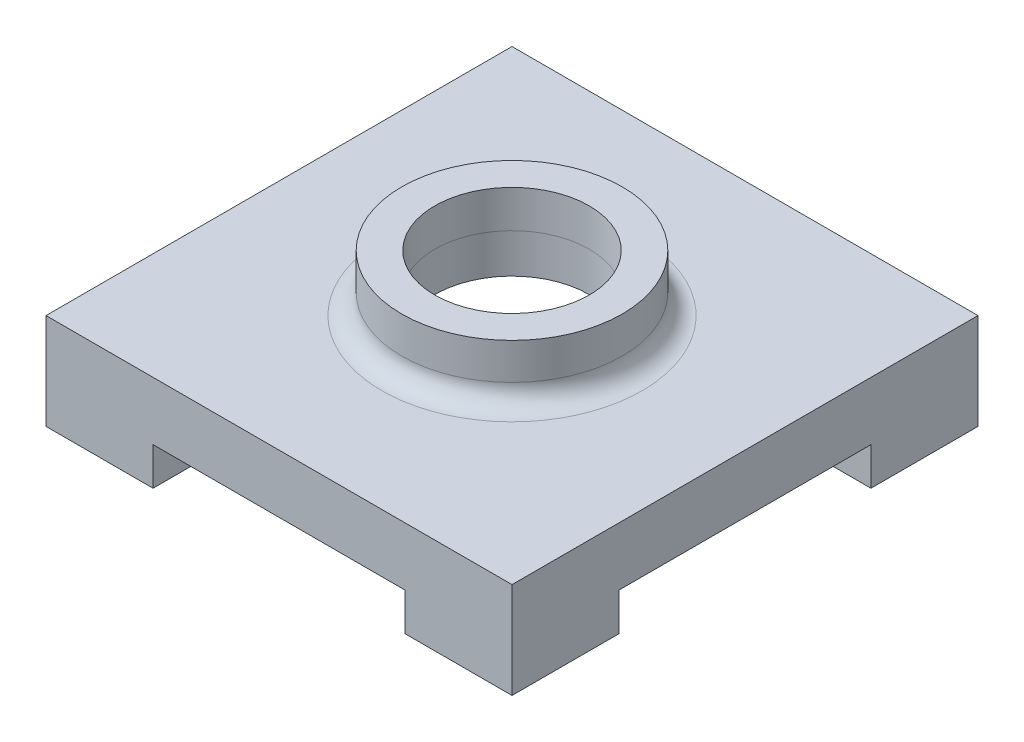
ISO-10303-21;
HEADER;
FILE_DESCRIPTION(('STEP AP214'),'2;1');
FILE_NAME('part.step','',(''),(''),'','','');
FILE_SCHEMA(('AUTOMOTIVE_DESIGN { 1 0 10303 214 1 1 1 1 }'));
ENDSEC;
DATA;
#1=APPLICATION_CONTEXT('core data for automotive mechanical design processes');
#2=APPLICATION_PROTOCOL_DEFINITION('international standard','automotive_design',2000,#1);
#3=PRODUCT_CONTEXT('',#1,'mechanical');
#4=PRODUCT('Part','Part','',(#3));
#5=PRODUCT_RELATED_PRODUCT_CATEGORY('part','',(#4));
#6=PRODUCT_DEFINITION_FORMATION('','',#4);
#7=PRODUCT_DEFINITION_CONTEXT('part definition',#1,'design');
#8=PRODUCT_DEFINITION('design','',#6,#7);
#9=PRODUCT_DEFINITION_SHAPE('','',#8);
#10=(LENGTH_UNIT() NAMED_UNIT(*) SI_UNIT(.MILLI.,.METRE.));
#11=(NAMED_UNIT(*) PLANE_ANGLE_UNIT() SI_UNIT($,.RADIAN.));
#12=(NAMED_UNIT(*) SI_UNIT($,.STERADIAN.) SOLID_ANGLE_UNIT());
#13=UNCERTAINTY_MEASURE_WITH_UNIT(LENGTH_MEASURE(1.E-05),#10,'distance_accuracy_value','');
#14=(GEOMETRIC_REPRESENTATION_CONTEXT(3) GLOBAL_UNCERTAINTY_ASSIGNED_CONTEXT((#13)) GLOBAL_UNIT_ASSIGNED_CONTEXT((#10,
#11,#12)) REPRESENTATION_CONTEXT('',''));
#15=CARTESIAN_POINT('',(0.,0.,0.));
#16=DIRECTION('',(0.,0.,1.));
#17=DIRECTION('',(1.,0.,0.));
#18=AXIS2_PLACEMENT_3D('',#15,#16,#17);
#19=CARTESIAN_POINT('',(0.,18.25,0.));
#20=DIRECTION('',(0.,1.,0.));
#21=DIRECTION('',(0.,0.,1.));
#22=AXIS2_PLACEMENT_3D('',#19,#20,#21);
#23=CYLINDRICAL_SURFACE('',#22,12.2682);
#24=CARTESIAN_POINT('',(0.,18.25,0.));
#25=DIRECTION('',(0.,1.,0.));
#26=DIRECTION('',(0.,0.,1.));
#27=AXIS2_PLACEMENT_3D('',#24,#25,#26);
#28=CIRCLE('',#27,12.2682);
#29=CARTESIAN_POINT('',(0.,18.25,12.2682));
#30=VERTEX_POINT('',#29);
#31=EDGE_CURVE('E479',#30,#30,#28,.F.);
#32=ORIENTED_EDGE('',*,*,#31,.F.);
#33=EDGE_LOOP('',(#32));
#34=FACE_BOUND('',#33,.T.);
#35=CARTESIAN_POINT('',(0.,12.,0.));
#36=DIRECTION('',(0.,-1.,0.));
#37=DIRECTION('',(0.,0.,-1.));
#38=AXIS2_PLACEMENT_3D('',#35,#36,#37);
#39=CIRCLE('',#38,12.2682);
#40=CARTESIAN_POINT('',(0.,12.,-12.2682));
#41=VERTEX_POINT('',#40);
#42=EDGE_CURVE('E52',#41,#41,#39,.F.);
#43=ORIENTED_EDGE('',*,*,#42,.F.);
#44=EDGE_LOOP('',(#43));
#45=FACE_BOUND('',#44,.T.);
#46=ADVANCED_FACE('F48',(#34,#45),#23,.F.);
#47=CARTESIAN_POINT('',(0.,6.,0.));
#48=DIRECTION('',(0.,1.,0.));
#49=DIRECTION('',(0.,0.,1.));
#50=AXIS2_PLACEMENT_3D('',#47,#48,#49);
#51=PLANE('',#50);
#52=DIRECTION('',(0.,0.,1.));
#53=VECTOR('',#52,1.);
#54=CARTESIAN_POINT('',(-37.,6.,0.));
#55=LINE('',#54,#53);
#56=CARTESIAN_POINT('',(-37.,6.,-20.));
#57=VERTEX_POINT('',#56);
#58=CARTESIAN_POINT('',(-37.,6.,20.));
#59=VERTEX_POINT('',#58);
#60=EDGE_CURVE('E333',#57,#59,#55,.T.);
#61=ORIENTED_EDGE('',*,*,#60,.F.);
#62=DIRECTION('',(1.,0.,0.));
#63=VECTOR('',#62,1.);
#64=CARTESIAN_POINT('',(-40.,6.,-20.));
#65=LINE('',#64,#63);
#66=CARTESIAN_POINT('',(-25.,6.,-20.));
#67=VERTEX_POINT('',#66);
#68=EDGE_CURVE('E452',#57,#67,#65,.T.);
#69=ORIENTED_EDGE('',*,*,#68,.T.);
#70=DIRECTION('',(0.,0.,1.));
#71=VECTOR('',#70,1.);
#72=CARTESIAN_POINT('',(-25.,6.,0.));
#73=LINE('',#72,#71);
#74=CARTESIAN_POINT('',(-25.,6.,20.));
#75=VERTEX_POINT('',#74);
#76=EDGE_CURVE('E419',#67,#75,#73,.T.);
#77=ORIENTED_EDGE('',*,*,#76,.T.);
#78=DIRECTION('',(-1.,0.,0.));
#79=VECTOR('',#78,1.);
#80=CARTESIAN_POINT('',(40.,6.,20.));
#81=LINE('',#80,#79);
#82=EDGE_CURVE('E455',#75,#59,#81,.T.);
#83=ORIENTED_EDGE('',*,*,#82,.T.);
#84=EDGE_LOOP('',(#61,#69,#77,#83));
#85=FACE_BOUND('',#84,.T.);
#86=ADVANCED_FACE('F565',(#85),#51,.F.);
#87=DIRECTION('',(1.,0.,0.));
#88=VECTOR('',#87,1.);
#89=CARTESIAN_POINT('',(0.,6.,37.));
#90=LINE('',#89,#88);
#91=CARTESIAN_POINT('',(-20.,6.,37.));
#92=VERTEX_POINT('',#91);
#93=CARTESIAN_POINT('',(20.,6.,37.));
#94=VERTEX_POINT('',#93);
#95=EDGE_CURVE('E356',#92,#94,#90,.T.);
#96=ORIENTED_EDGE('',*,*,#95,.F.);
#97=DIRECTION('',(0.,0.,-1.));
#98=VECTOR('',#97,1.);
#99=CARTESIAN_POINT('',(-20.,6.,-40.));
#100=LINE('',#99,#98);
#101=CARTESIAN_POINT('',(-20.,6.,25.));
#102=VERTEX_POINT('',#101);
#103=EDGE_CURVE('E484',#92,#102,#100,.T.);
#104=ORIENTED_EDGE('',*,*,#103,.T.);
#105=DIRECTION('',(1.,0.,0.));
#106=VECTOR('',#105,1.);
#107=CARTESIAN_POINT('',(0.,6.,25.));
#108=LINE('',#107,#106);
#109=CARTESIAN_POINT('',(20.,6.,25.));
#110=VERTEX_POINT('',#109);
#111=EDGE_CURVE('E511',#102,#110,#108,.T.);
#112=ORIENTED_EDGE('',*,*,#111,.T.);
#113=DIRECTION('',(0.,0.,1.));
#114=VECTOR('',#113,1.);
#115=CARTESIAN_POINT('',(20.,6.,40.));
#116=LINE('',#115,#114);
#117=EDGE_CURVE('E487',#110,#94,#116,.T.);
#118=ORIENTED_EDGE('',*,*,#117,.T.);
#119=EDGE_LOOP('',(#96,#104,#112,#118));
#120=FACE_BOUND('',#119,.T.);
#121=ADVANCED_FACE('F594',(#120),#51,.F.);
#122=DIRECTION('',(0.,0.,-1.));
#123=VECTOR('',#122,1.);
#124=CARTESIAN_POINT('',(37.,6.,0.));
#125=LINE('',#124,#123);
#126=CARTESIAN_POINT('',(37.,6.,20.));
#127=VERTEX_POINT('',#126);
#128=CARTESIAN_POINT('',(37.,6.,-20.));
#129=VERTEX_POINT('',#128);
#130=EDGE_CURVE('E347',#127,#129,#125,.T.);
#131=ORIENTED_EDGE('',*,*,#130,.F.);
#132=CARTESIAN_POINT('',(25.,6.,20.));
#133=VERTEX_POINT('',#132);
#134=EDGE_CURVE('E457',#127,#133,#81,.T.);
#135=ORIENTED_EDGE('',*,*,#134,.T.);
#136=DIRECTION('',(0.,0.,-1.));
#137=VECTOR('',#136,1.);
#138=CARTESIAN_POINT('',(25.,6.,0.));
#139=LINE('',#138,#137);
#140=CARTESIAN_POINT('',(25.,6.,-20.));
#141=VERTEX_POINT('',#140);
#142=EDGE_CURVE('E427',#133,#141,#139,.T.);
#143=ORIENTED_EDGE('',*,*,#142,.T.);
#144=EDGE_CURVE('E456',#141,#129,#65,.T.);
#145=ORIENTED_EDGE('',*,*,#144,.T.);
#146=EDGE_LOOP('',(#131,#135,#143,#145));
#147=FACE_BOUND('',#146,.T.);
#148=ADVANCED_FACE('F616',(#147),#51,.F.);
#149=CARTESIAN_POINT('',(-40.,0.,0.));
#150=DIRECTION('',(0.,-1.,0.));
#151=DIRECTION('',(0.,0.,-1.));
#152=AXIS2_PLACEMENT_3D('',#149,#150,#151);
#153=PLANE('',#152);
#154=CARTESIAN_POINT('',(-27.5,0.,27.5));
#155=DIRECTION('',(0.,-1.,0.));
#156=DIRECTION('',(0.,0.,-1.));
#157=AXIS2_PLACEMENT_3D('',#154,#155,#156);
#158=CIRCLE('',#157,1.65);
#159=CARTESIAN_POINT('',(-27.5,0.,25.85));
#160=VERTEX_POINT('',#159);
#161=EDGE_CURVE('E395',#160,#160,#158,.T.);
#162=ORIENTED_EDGE('',*,*,#161,.F.);
#163=EDGE_LOOP('',(#162));
#164=FACE_BOUND('',#163,.T.);
#165=DIRECTION('',(1.,0.,0.));
#166=VECTOR('',#165,1.);
#167=CARTESIAN_POINT('',(-37.,0.,37.));
#168=LINE('',#167,#166);
#169=CARTESIAN_POINT('',(-37.,0.,37.));
#170=VERTEX_POINT('',#169);
#171=CARTESIAN_POINT('',(-20.,0.,37.));
#172=VERTEX_POINT('',#171);
#173=EDGE_CURVE('E304',#170,#172,#168,.T.);
#174=ORIENTED_EDGE('',*,*,#173,.F.);
#175=DIRECTION('',(0.,0.,1.));
#176=VECTOR('',#175,1.);
#177=CARTESIAN_POINT('',(-37.,0.,-37.));
#178=LINE('',#177,#176);
#179=CARTESIAN_POINT('',(-37.,0.,20.));
#180=VERTEX_POINT('',#179);
#181=EDGE_CURVE('E303',#180,#170,#178,.T.);
#182=ORIENTED_EDGE('',*,*,#181,.F.);
#183=DIRECTION('',(-1.,0.,0.));
#184=VECTOR('',#183,1.);
#185=CARTESIAN_POINT('',(40.,0.,20.));
#186=LINE('',#185,#184);
#187=CARTESIAN_POINT('',(-25.,0.,20.));
#188=VERTEX_POINT('',#187);
#189=EDGE_CURVE('E464',#188,#180,#186,.T.);
#190=ORIENTED_EDGE('',*,*,#189,.F.);
#191=DIRECTION('',(0.,0.,-1.));
#192=VECTOR('',#191,1.);
#193=CARTESIAN_POINT('',(-25.,0.,25.));
#194=LINE('',#193,#192);
#195=CARTESIAN_POINT('',(-25.,0.,21.825));
#196=VERTEX_POINT('',#195);
#197=EDGE_CURVE('E404',#196,#188,#194,.T.);
#198=ORIENTED_EDGE('',*,*,#197,.F.);
#199=CARTESIAN_POINT('',(-21.825,0.,21.825));
#200=DIRECTION('',(0.,-1.,0.));
#201=DIRECTION('',(0.,0.,-1.));
#202=AXIS2_PLACEMENT_3D('',#199,#200,#201);
#203=CIRCLE('',#202,3.175);
#204=CARTESIAN_POINT('',(-21.825,0.,25.));
#205=VERTEX_POINT('',#204);
#206=EDGE_CURVE('E545',#196,#205,#203,.F.);
#207=ORIENTED_EDGE('',*,*,#206,.T.);
#208=DIRECTION('',(-1.,0.,0.));
#209=VECTOR('',#208,1.);
#210=CARTESIAN_POINT('',(25.,0.,25.));
#211=LINE('',#210,#209);
#212=CARTESIAN_POINT('',(-20.,0.,25.));
#213=VERTEX_POINT('',#212);
#214=EDGE_CURVE('E415',#213,#205,#211,.T.);
#215=ORIENTED_EDGE('',*,*,#214,.F.);
#216=DIRECTION('',(0.,0.,-1.));
#217=VECTOR('',#216,1.);
#218=CARTESIAN_POINT('',(-20.,0.,-40.));
#219=LINE('',#218,#217);
#220=EDGE_CURVE('E493',#172,#213,#219,.T.);
#221=ORIENTED_EDGE('',*,*,#220,.F.);
#222=EDGE_LOOP('',(#174,#182,#190,#198,#207,#215,#221));
#223=FACE_BOUND('',#222,.T.);
#224=ADVANCED_FACE('F613',(#164,#223),#153,.T.);
#225=CARTESIAN_POINT('',(27.5,0.,27.5));
#226=DIRECTION('',(0.,-1.,0.));
#227=DIRECTION('',(0.,0.,-1.));
#228=AXIS2_PLACEMENT_3D('',#225,#226,#227);
#229=CIRCLE('',#228,1.65);
#230=CARTESIAN_POINT('',(27.5,0.,25.85));
#231=VERTEX_POINT('',#230);
#232=EDGE_CURVE('E387',#231,#231,#229,.T.);
#233=ORIENTED_EDGE('',*,*,#232,.F.);
#234=EDGE_LOOP('',(#233));
#235=FACE_BOUND('',#234,.T.);
#236=CARTESIAN_POINT('',(37.,0.,20.));
#237=VERTEX_POINT('',#236);
#238=CARTESIAN_POINT('',(25.,0.,20.));
#239=VERTEX_POINT('',#238);
#240=EDGE_CURVE('E465',#237,#239,#186,.T.);
#241=ORIENTED_EDGE('',*,*,#240,.F.);
#242=DIRECTION('',(0.,0.,-1.));
#243=VECTOR('',#242,1.);
#244=CARTESIAN_POINT('',(37.,0.,37.));
#245=LINE('',#244,#243);
#246=CARTESIAN_POINT('',(37.,0.,37.));
#247=VERTEX_POINT('',#246);
#248=EDGE_CURVE('E308',#247,#237,#245,.T.);
#249=ORIENTED_EDGE('',*,*,#248,.F.);
#250=CARTESIAN_POINT('',(20.,0.,37.));
#251=VERTEX_POINT('',#250);
#252=EDGE_CURVE('E302',#251,#247,#168,.T.);
#253=ORIENTED_EDGE('',*,*,#252,.F.);
#254=DIRECTION('',(0.,0.,1.));
#255=VECTOR('',#254,1.);
#256=CARTESIAN_POINT('',(20.,0.,40.));
#257=LINE('',#256,#255);
#258=CARTESIAN_POINT('',(20.,0.,25.));
#259=VERTEX_POINT('',#258);
#260=EDGE_CURVE('E496',#259,#251,#257,.T.);
#261=ORIENTED_EDGE('',*,*,#260,.F.);
#262=CARTESIAN_POINT('',(21.825,0.,25.));
#263=VERTEX_POINT('',#262);
#264=EDGE_CURVE('E416',#263,#259,#211,.T.);
#265=ORIENTED_EDGE('',*,*,#264,.F.);
#266=CARTESIAN_POINT('',(21.825,0.,21.825));
#267=DIRECTION('',(0.,-1.,0.));
#268=DIRECTION('',(0.,0.,-1.));
#269=AXIS2_PLACEMENT_3D('',#266,#267,#268);
#270=CIRCLE('',#269,3.175);
#271=CARTESIAN_POINT('',(25.,0.,21.825));
#272=VERTEX_POINT('',#271);
#273=EDGE_CURVE('E255',#263,#272,#270,.F.);
#274=ORIENTED_EDGE('',*,*,#273,.T.);
#275=DIRECTION('',(0.,0.,1.));
#276=VECTOR('',#275,1.);
#277=CARTESIAN_POINT('',(25.,0.,-25.));
#278=LINE('',#277,#276);
#279=EDGE_CURVE('E411',#239,#272,#278,.T.);
#280=ORIENTED_EDGE('',*,*,#279,.F.);
#281=EDGE_LOOP('',(#241,#249,#253,#261,#265,#274,#280));
#282=FACE_BOUND('',#281,.T.);
#283=ADVANCED_FACE('F610',(#235,#282),#153,.T.);
#284=CARTESIAN_POINT('',(-20.,6.,-40.));
#285=DIRECTION('',(-1.,0.,0.));
#286=DIRECTION('',(0.,0.,1.));
#287=AXIS2_PLACEMENT_3D('',#284,#285,#286);
#288=PLANE('',#287);
#289=DIRECTION('',(0.,1.,0.));
#290=VECTOR('',#289,1.);
#291=CARTESIAN_POINT('',(-20.,5.99999999999999,37.));
#292=LINE('',#291,#290);
#293=EDGE_CURVE('E359',#172,#92,#292,.T.);
#294=ORIENTED_EDGE('',*,*,#293,.F.);
#295=ORIENTED_EDGE('',*,*,#220,.T.);
#296=DIRECTION('',(0.,1.,0.));
#297=VECTOR('',#296,1.);
#298=CARTESIAN_POINT('',(-20.,6.,25.));
#299=LINE('',#298,#297);
#300=EDGE_CURVE('E447',#213,#102,#299,.T.);
#301=ORIENTED_EDGE('',*,*,#300,.T.);
#302=ORIENTED_EDGE('',*,*,#103,.F.);
#303=EDGE_LOOP('',(#294,#295,#301,#302));
#304=FACE_BOUND('',#303,.T.);
#305=ADVANCED_FACE('F605',(#304),#288,.F.);
#306=CARTESIAN_POINT('',(20.,6.,40.));
#307=DIRECTION('',(1.,0.,0.));
#308=DIRECTION('',(0.,0.,-1.));
#309=AXIS2_PLACEMENT_3D('',#306,#307,#308);
#310=PLANE('',#309);
#311=DIRECTION('',(0.,-1.,0.));
#312=VECTOR('',#311,1.);
#313=CARTESIAN_POINT('',(20.,6.,37.));
#314=LINE('',#313,#312);
#315=EDGE_CURVE('E353',#94,#251,#314,.T.);
#316=ORIENTED_EDGE('',*,*,#315,.F.);
#317=ORIENTED_EDGE('',*,*,#117,.F.);
#318=DIRECTION('',(0.,-1.,0.));
#319=VECTOR('',#318,1.);
#320=CARTESIAN_POINT('',(20.,6.,25.));
#321=LINE('',#320,#319);
#322=EDGE_CURVE('E443',#110,#259,#321,.T.);
#323=ORIENTED_EDGE('',*,*,#322,.T.);
#324=ORIENTED_EDGE('',*,*,#260,.T.);
#325=EDGE_LOOP('',(#316,#317,#323,#324));
#326=FACE_BOUND('',#325,.T.);
#327=ADVANCED_FACE('F602',(#326),#310,.F.);
#328=CARTESIAN_POINT('',(-27.5,0.,-27.5));
#329=DIRECTION('',(0.,-1.,0.));
#330=DIRECTION('',(0.,0.,-1.));
#331=AXIS2_PLACEMENT_3D('',#328,#329,#330);
#332=CIRCLE('',#331,1.65);
#333=CARTESIAN_POINT('',(-27.5,0.,-29.15));
#334=VERTEX_POINT('',#333);
#335=EDGE_CURVE('E371',#334,#334,#332,.T.);
#336=ORIENTED_EDGE('',*,*,#335,.F.);
#337=EDGE_LOOP('',(#336));
#338=FACE_BOUND('',#337,.T.);
#339=DIRECTION('',(1.,0.,0.));
#340=VECTOR('',#339,1.);
#341=CARTESIAN_POINT('',(-40.,0.,-20.));
#342=LINE('',#341,#340);
#343=CARTESIAN_POINT('',(-37.,0.,-20.));
#344=VERTEX_POINT('',#343);
#345=CARTESIAN_POINT('',(-25.,0.,-20.));
#346=VERTEX_POINT('',#345);
#347=EDGE_CURVE('E461',#344,#346,#342,.T.);
#348=ORIENTED_EDGE('',*,*,#347,.F.);
#349=CARTESIAN_POINT('',(-37.,0.,-37.));
#350=VERTEX_POINT('',#349);
#351=EDGE_CURVE('E73',#350,#344,#178,.T.);
#352=ORIENTED_EDGE('',*,*,#351,.F.);
#353=DIRECTION('',(-1.,0.,0.));
#354=VECTOR('',#353,1.);
#355=CARTESIAN_POINT('',(37.,0.,-37.));
#356=LINE('',#355,#354);
#357=CARTESIAN_POINT('',(-20.,0.,-37.));
#358=VERTEX_POINT('',#357);
#359=EDGE_CURVE('E311',#358,#350,#356,.T.);
#360=ORIENTED_EDGE('',*,*,#359,.F.);
#361=CARTESIAN_POINT('',(-20.,0.,-25.));
#362=VERTEX_POINT('',#361);
#363=EDGE_CURVE('E483',#362,#358,#219,.T.);
#364=ORIENTED_EDGE('',*,*,#363,.F.);
#365=DIRECTION('',(1.,0.,0.));
#366=VECTOR('',#365,1.);
#367=CARTESIAN_POINT('',(-25.,0.,-25.));
#368=LINE('',#367,#366);
#369=CARTESIAN_POINT('',(-21.825,0.,-25.));
#370=VERTEX_POINT('',#369);
#371=EDGE_CURVE('E408',#370,#362,#368,.T.);
#372=ORIENTED_EDGE('',*,*,#371,.F.);
#373=CARTESIAN_POINT('',(-21.825,0.,-21.825));
#374=DIRECTION('',(0.,-1.,0.));
#375=DIRECTION('',(0.,0.,-1.));
#376=AXIS2_PLACEMENT_3D('',#373,#374,#375);
#377=CIRCLE('',#376,3.175);
#378=CARTESIAN_POINT('',(-25.,0.,-21.825));
#379=VERTEX_POINT('',#378);
#380=EDGE_CURVE('E553',#370,#379,#377,.F.);
#381=ORIENTED_EDGE('',*,*,#380,.T.);
#382=EDGE_CURVE('E403',#346,#379,#194,.T.);
#383=ORIENTED_EDGE('',*,*,#382,.F.);
#384=EDGE_LOOP('',(#348,#352,#360,#364,#372,#381,#383));
#385=FACE_BOUND('',#384,.T.);
#386=ADVANCED_FACE('F576',(#338,#385),#153,.T.);
#387=CARTESIAN_POINT('',(27.5,0.,-27.5));
#388=DIRECTION('',(0.,-1.,0.));
#389=DIRECTION('',(0.,0.,-1.));
#390=AXIS2_PLACEMENT_3D('',#387,#388,#389);
#391=CIRCLE('',#390,1.65);
#392=CARTESIAN_POINT('',(27.5,0.,-29.15));
#393=VERTEX_POINT('',#392);
#394=EDGE_CURVE('E379',#393,#393,#391,.T.);
#395=ORIENTED_EDGE('',*,*,#394,.F.);
#396=EDGE_LOOP('',(#395));
#397=FACE_BOUND('',#396,.T.);
#398=CARTESIAN_POINT('',(20.,0.,-37.));
#399=VERTEX_POINT('',#398);
#400=CARTESIAN_POINT('',(20.,0.,-25.));
#401=VERTEX_POINT('',#400);
#402=EDGE_CURVE('E497',#399,#401,#257,.T.);
#403=ORIENTED_EDGE('',*,*,#402,.F.);
#404=CARTESIAN_POINT('',(37.,0.,-37.));
#405=VERTEX_POINT('',#404);
#406=EDGE_CURVE('E312',#405,#399,#356,.T.);
#407=ORIENTED_EDGE('',*,*,#406,.F.);
#408=CARTESIAN_POINT('',(37.,0.,-20.));
#409=VERTEX_POINT('',#408);
#410=EDGE_CURVE('E307',#409,#405,#245,.T.);
#411=ORIENTED_EDGE('',*,*,#410,.F.);
#412=CARTESIAN_POINT('',(25.,0.,-20.));
#413=VERTEX_POINT('',#412);
#414=EDGE_CURVE('E451',#413,#409,#342,.T.);
#415=ORIENTED_EDGE('',*,*,#414,.F.);
#416=CARTESIAN_POINT('',(25.,0.,-21.825));
#417=VERTEX_POINT('',#416);
#418=EDGE_CURVE('E412',#417,#413,#278,.T.);
#419=ORIENTED_EDGE('',*,*,#418,.F.);
#420=CARTESIAN_POINT('',(21.825,0.,-21.825));
#421=DIRECTION('',(0.,-1.,0.));
#422=DIRECTION('',(0.,0.,-1.));
#423=AXIS2_PLACEMENT_3D('',#420,#421,#422);
#424=CIRCLE('',#423,3.175);
#425=CARTESIAN_POINT('',(21.825,0.,-25.));
#426=VERTEX_POINT('',#425);
#427=EDGE_CURVE('E550',#417,#426,#424,.F.);
#428=ORIENTED_EDGE('',*,*,#427,.T.);
#429=EDGE_CURVE('E407',#401,#426,#368,.T.);
#430=ORIENTED_EDGE('',*,*,#429,.F.);
#431=EDGE_LOOP('',(#403,#407,#411,#415,#419,#428,#430));
#432=FACE_BOUND('',#431,.T.);
#433=ADVANCED_FACE('F618',(#397,#432),#153,.T.);
#434=DIRECTION('',(0.,-1.,0.));
#435=VECTOR('',#434,1.);
#436=CARTESIAN_POINT('',(-20.,6.,-37.));
#437=LINE('',#436,#435);
#438=CARTESIAN_POINT('',(-20.,6.,-37.));
#439=VERTEX_POINT('',#438);
#440=EDGE_CURVE('E368',#439,#358,#437,.T.);
#441=ORIENTED_EDGE('',*,*,#440,.F.);
#442=CARTESIAN_POINT('',(-20.,6.,-25.));
#443=VERTEX_POINT('',#442);
#444=EDGE_CURVE('E488',#443,#439,#100,.T.);
#445=ORIENTED_EDGE('',*,*,#444,.F.);
#446=DIRECTION('',(0.,-1.,0.));
#447=VECTOR('',#446,1.);
#448=CARTESIAN_POINT('',(-20.,6.,-25.));
#449=LINE('',#448,#447);
#450=EDGE_CURVE('E439',#443,#362,#449,.T.);
#451=ORIENTED_EDGE('',*,*,#450,.T.);
#452=ORIENTED_EDGE('',*,*,#363,.T.);
#453=EDGE_LOOP('',(#441,#445,#451,#452));
#454=FACE_BOUND('',#453,.T.);
#455=ADVANCED_FACE('F612',(#454),#288,.F.);
#456=DIRECTION('',(0.,1.,0.));
#457=VECTOR('',#456,1.);
#458=CARTESIAN_POINT('',(20.,6.00000000000001,-37.));
#459=LINE('',#458,#457);
#460=CARTESIAN_POINT('',(20.,6.,-37.));
#461=VERTEX_POINT('',#460);
#462=EDGE_CURVE('E365',#399,#461,#459,.T.);
#463=ORIENTED_EDGE('',*,*,#462,.F.);
#464=ORIENTED_EDGE('',*,*,#402,.T.);
#465=DIRECTION('',(0.,1.,0.));
#466=VECTOR('',#465,1.);
#467=CARTESIAN_POINT('',(20.,6.,-25.));
#468=LINE('',#467,#466);
#469=CARTESIAN_POINT('',(20.,6.,-25.));
#470=VERTEX_POINT('',#469);
#471=EDGE_CURVE('E435',#401,#470,#468,.T.);
#472=ORIENTED_EDGE('',*,*,#471,.T.);
#473=EDGE_CURVE('E489',#461,#470,#116,.T.);
#474=ORIENTED_EDGE('',*,*,#473,.F.);
#475=EDGE_LOOP('',(#463,#464,#472,#474));
#476=FACE_BOUND('',#475,.T.);
#477=ADVANCED_FACE('F607',(#476),#310,.F.);
#478=DIRECTION('',(-1.,0.,0.));
#479=VECTOR('',#478,1.);
#480=CARTESIAN_POINT('',(0.,6.,-37.));
#481=LINE('',#480,#479);
#482=EDGE_CURVE('E362',#461,#439,#481,.T.);
#483=ORIENTED_EDGE('',*,*,#482,.F.);
#484=ORIENTED_EDGE('',*,*,#473,.T.);
#485=DIRECTION('',(-1.,0.,0.));
#486=VECTOR('',#485,1.);
#487=CARTESIAN_POINT('',(0.,6.,-25.));
#488=LINE('',#487,#486);
#489=EDGE_CURVE('E507',#470,#443,#488,.T.);
#490=ORIENTED_EDGE('',*,*,#489,.T.);
#491=ORIENTED_EDGE('',*,*,#444,.T.);
#492=EDGE_LOOP('',(#483,#484,#490,#491));
#493=FACE_BOUND('',#492,.T.);
#494=ADVANCED_FACE('F596',(#493),#51,.F.);
#495=CARTESIAN_POINT('',(0.,15.25,0.));
#496=DIRECTION('',(0.,-1.,0.));
#497=DIRECTION('',(0.,0.,-1.));
#498=AXIS2_PLACEMENT_3D('',#495,#496,#497);
#499=PLANE('',#498);
#500=CARTESIAN_POINT('',(0.,15.25,0.));
#501=DIRECTION('',(0.,-1.,0.));
#502=DIRECTION('',(0.,0.,-1.));
#503=AXIS2_PLACEMENT_3D('',#500,#501,#502);
#504=CIRCLE('',#503,20.675);
#505=CARTESIAN_POINT('',(0.,15.25,-20.675));
#506=VERTEX_POINT('',#505);
#507=EDGE_CURVE('E541',#506,#506,#504,.T.);
#508=ORIENTED_EDGE('',*,*,#507,.T.);
#509=EDGE_LOOP('',(#508));
#510=FACE_BOUND('',#509,.T.);
#511=DIRECTION('',(0.,0.,1.));
#512=VECTOR('',#511,1.);
#513=CARTESIAN_POINT('',(-37.,15.25,-37.));
#514=LINE('',#513,#512);
#515=CARTESIAN_POINT('',(-37.,15.25,-37.));
#516=VERTEX_POINT('',#515);
#517=CARTESIAN_POINT('',(-37.,15.25,37.));
#518=VERTEX_POINT('',#517);
#519=EDGE_CURVE('E316',#516,#518,#514,.T.);
#520=ORIENTED_EDGE('',*,*,#519,.T.);
#521=DIRECTION('',(1.,0.,0.));
#522=VECTOR('',#521,1.);
#523=CARTESIAN_POINT('',(-37.,15.25,37.));
#524=LINE('',#523,#522);
#525=CARTESIAN_POINT('',(37.,15.25,37.));
#526=VERTEX_POINT('',#525);
#527=EDGE_CURVE('E320',#518,#526,#524,.T.);
#528=ORIENTED_EDGE('',*,*,#527,.T.);
#529=DIRECTION('',(0.,0.,-1.));
#530=VECTOR('',#529,1.);
#531=CARTESIAN_POINT('',(37.,15.25,37.));
#532=LINE('',#531,#530);
#533=CARTESIAN_POINT('',(37.,15.25,-37.));
#534=VERTEX_POINT('',#533);
#535=EDGE_CURVE('E65',#526,#534,#532,.T.);
#536=ORIENTED_EDGE('',*,*,#535,.T.);
#537=DIRECTION('',(-1.,0.,0.));
#538=VECTOR('',#537,1.);
#539=CARTESIAN_POINT('',(37.,15.25,-37.));
#540=LINE('',#539,#538);
#541=EDGE_CURVE('E326',#534,#516,#540,.T.);
#542=ORIENTED_EDGE('',*,*,#541,.T.);
#543=EDGE_LOOP('',(#520,#528,#536,#542));
#544=FACE_BOUND('',#543,.T.);
#545=ADVANCED_FACE('F719',(#510,#544),#499,.F.);
#546=CARTESIAN_POINT('',(-40.,6.,-20.));
#547=DIRECTION('',(0.,0.,-1.));
#548=DIRECTION('',(-1.,0.,0.));
#549=AXIS2_PLACEMENT_3D('',#546,#547,#548);
#550=PLANE('',#549);
#551=DIRECTION('',(0.,-1.,0.));
#552=VECTOR('',#551,1.);
#553=CARTESIAN_POINT('',(37.,6.,-20.));
#554=LINE('',#553,#552);
#555=EDGE_CURVE('E350',#129,#409,#554,.T.);
#556=ORIENTED_EDGE('',*,*,#555,.F.);
#557=ORIENTED_EDGE('',*,*,#144,.F.);
#558=DIRECTION('',(0.,-1.,0.));
#559=VECTOR('',#558,1.);
#560=CARTESIAN_POINT('',(25.,6.,-20.));
#561=LINE('',#560,#559);
#562=EDGE_CURVE('E431',#141,#413,#561,.T.);
#563=ORIENTED_EDGE('',*,*,#562,.T.);
#564=ORIENTED_EDGE('',*,*,#414,.T.);
#565=EDGE_LOOP('',(#556,#557,#563,#564));
#566=FACE_BOUND('',#565,.T.);
#567=ADVANCED_FACE('F696',(#566),#550,.F.);
#568=CARTESIAN_POINT('',(40.,6.,20.));
#569=DIRECTION('',(0.,0.,1.));
#570=DIRECTION('',(1.,0.,0.));
#571=AXIS2_PLACEMENT_3D('',#568,#569,#570);
#572=PLANE('',#571);
#573=DIRECTION('',(0.,1.,0.));
#574=VECTOR('',#573,1.);
#575=CARTESIAN_POINT('',(37.,6.,20.));
#576=LINE('',#575,#574);
#577=EDGE_CURVE('E12',#237,#127,#576,.T.);
#578=ORIENTED_EDGE('',*,*,#577,.F.);
#579=ORIENTED_EDGE('',*,*,#240,.T.);
#580=DIRECTION('',(0.,1.,0.));
#581=VECTOR('',#580,1.);
#582=CARTESIAN_POINT('',(25.,6.,20.));
#583=LINE('',#582,#581);
#584=EDGE_CURVE('E503',#239,#133,#583,.T.);
#585=ORIENTED_EDGE('',*,*,#584,.T.);
#586=ORIENTED_EDGE('',*,*,#134,.F.);
#587=EDGE_LOOP('',(#578,#579,#585,#586));
#588=FACE_BOUND('',#587,.T.);
#589=ADVANCED_FACE('F724',(#588),#572,.F.);
#590=DIRECTION('',(0.,-1.,0.));
#591=VECTOR('',#590,1.);
#592=CARTESIAN_POINT('',(-37.,6.,20.));
#593=LINE('',#592,#591);
#594=EDGE_CURVE('E344',#59,#180,#593,.T.);
#595=ORIENTED_EDGE('',*,*,#594,.F.);
#596=ORIENTED_EDGE('',*,*,#82,.F.);
#597=DIRECTION('',(0.,-1.,0.));
#598=VECTOR('',#597,1.);
#599=CARTESIAN_POINT('',(-25.,6.,20.));
#600=LINE('',#599,#598);
#601=EDGE_CURVE('E423',#75,#188,#600,.T.);
#602=ORIENTED_EDGE('',*,*,#601,.T.);
#603=ORIENTED_EDGE('',*,*,#189,.T.);
#604=EDGE_LOOP('',(#595,#596,#602,#603));
#605=FACE_BOUND('',#604,.T.);
#606=ADVANCED_FACE('F726',(#605),#572,.F.);
#607=DIRECTION('',(0.,1.,0.));
#608=VECTOR('',#607,1.);
#609=CARTESIAN_POINT('',(-37.,6.,-20.));
#610=LINE('',#609,#608);
#611=EDGE_CURVE('E58',#344,#57,#610,.T.);
#612=ORIENTED_EDGE('',*,*,#611,.F.);
#613=ORIENTED_EDGE('',*,*,#347,.T.);
#614=DIRECTION('',(0.,1.,0.));
#615=VECTOR('',#614,1.);
#616=CARTESIAN_POINT('',(-25.,6.,-20.));
#617=LINE('',#616,#615);
#618=EDGE_CURVE('E492',#346,#67,#617,.T.);
#619=ORIENTED_EDGE('',*,*,#618,.T.);
#620=ORIENTED_EDGE('',*,*,#68,.F.);
#621=EDGE_LOOP('',(#612,#613,#619,#620));
#622=FACE_BOUND('',#621,.T.);
#623=ADVANCED_FACE('F568',(#622),#550,.F.);
#624=CARTESIAN_POINT('',(0.,18.25,0.));
#625=DIRECTION('',(0.,1.,0.));
#626=DIRECTION('',(0.,0.,1.));
#627=AXIS2_PLACEMENT_3D('',#624,#625,#626);
#628=PLANE('',#627);
#629=CARTESIAN_POINT('',(0.,18.25,0.));
#630=DIRECTION('',(0.,1.,0.));
#631=DIRECTION('',(0.,0.,1.));
#632=AXIS2_PLACEMENT_3D('',#629,#630,#631);
#633=CIRCLE('',#632,12.268);
#634=CARTESIAN_POINT('',(0.,18.25,12.268));
#635=VERTEX_POINT('',#634);
#636=EDGE_CURVE('E460',#635,#635,#633,.T.);
#637=ORIENTED_EDGE('',*,*,#636,.T.);
#638=EDGE_LOOP('',(#637));
#639=FACE_BOUND('',#638,.T.);
#640=ORIENTED_EDGE('',*,*,#31,.T.);
#641=EDGE_LOOP('',(#640));
#642=FACE_BOUND('',#641,.T.);
#643=ADVANCED_FACE('F745',(#639,#642),#628,.F.);
#644=CARTESIAN_POINT('',(0.,24.2062,0.));
#645=DIRECTION('',(0.,1.,0.));
#646=DIRECTION('',(0.,0.,1.));
#647=AXIS2_PLACEMENT_3D('',#644,#645,#646);
#648=PLANE('',#647);
#649=CARTESIAN_POINT('',(0.,24.2062,0.));
#650=DIRECTION('',(0.,1.,0.));
#651=DIRECTION('',(0.,0.,1.));
#652=AXIS2_PLACEMENT_3D('',#649,#650,#651);
#653=CIRCLE('',#652,17.5);
#654=CARTESIAN_POINT('',(0.,24.2062,17.5));
#655=VERTEX_POINT('',#654);
#656=EDGE_CURVE('E472',#655,#655,#653,.T.);
#657=ORIENTED_EDGE('',*,*,#656,.T.);
#658=EDGE_LOOP('',(#657));
#659=FACE_BOUND('',#658,.T.);
#660=CARTESIAN_POINT('',(0.,24.2062,0.));
#661=DIRECTION('',(0.,1.,0.));
#662=DIRECTION('',(0.,0.,1.));
#663=AXIS2_PLACEMENT_3D('',#660,#661,#662);
#664=CIRCLE('',#663,12.268);
#665=CARTESIAN_POINT('',(0.,24.2062,12.268));
#666=VERTEX_POINT('',#665);
#667=EDGE_CURVE('E468',#666,#666,#664,.T.);
#668=ORIENTED_EDGE('',*,*,#667,.F.);
#669=EDGE_LOOP('',(#668));
#670=FACE_BOUND('',#669,.T.);
#671=ADVANCED_FACE('F743',(#659,#670),#648,.T.);
#672=CARTESIAN_POINT('',(0.,24.2062,0.));
#673=DIRECTION('',(0.,-1.,0.));
#674=DIRECTION('',(0.,0.,-1.));
#675=AXIS2_PLACEMENT_3D('',#672,#673,#674);
#676=CYLINDRICAL_SURFACE('',#675,17.5);
#677=CARTESIAN_POINT('',(0.,18.425,0.));
#678=DIRECTION('',(0.,-1.,0.));
#679=DIRECTION('',(0.,0.,-1.));
#680=AXIS2_PLACEMENT_3D('',#677,#678,#679);
#681=CIRCLE('',#680,17.5);
#682=CARTESIAN_POINT('',(0.,18.425,-17.5));
#683=VERTEX_POINT('',#682);
#684=EDGE_CURVE('E537',#683,#683,#681,.F.);
#685=ORIENTED_EDGE('',*,*,#684,.T.);
#686=EDGE_LOOP('',(#685));
#687=FACE_BOUND('',#686,.T.);
#688=ORIENTED_EDGE('',*,*,#656,.F.);
#689=EDGE_LOOP('',(#688));
#690=FACE_BOUND('',#689,.T.);
#691=ADVANCED_FACE('F599',(#687,#690),#676,.T.);
#692=CARTESIAN_POINT('',(0.,24.2062,0.));
#693=DIRECTION('',(0.,-1.,0.));
#694=DIRECTION('',(0.,0.,-1.));
#695=AXIS2_PLACEMENT_3D('',#692,#693,#694);
#696=CYLINDRICAL_SURFACE('',#695,12.268);
#697=ORIENTED_EDGE('',*,*,#667,.T.);
#698=EDGE_LOOP('',(#697));
#699=FACE_BOUND('',#698,.T.);
#700=ORIENTED_EDGE('',*,*,#636,.F.);
#701=EDGE_LOOP('',(#700));
#702=FACE_BOUND('',#701,.T.);
#703=ADVANCED_FACE('F739',(#699,#702),#696,.F.);
#704=CARTESIAN_POINT('',(25.,9.,25.));
#705=DIRECTION('',(0.,0.,1.));
#706=DIRECTION('',(1.,0.,0.));
#707=AXIS2_PLACEMENT_3D('',#704,#705,#706);
#708=PLANE('',#707);
#709=ORIENTED_EDGE('',*,*,#214,.T.);
#710=DIRECTION('',(0.,-1.,0.));
#711=VECTOR('',#710,1.);
#712=CARTESIAN_POINT('',(-21.825,9.,25.));
#713=LINE('',#712,#711);
#714=CARTESIAN_POINT('',(-21.825,12.,25.));
#715=VERTEX_POINT('',#714);
#716=EDGE_CURVE('E259',#205,#715,#713,.F.);
#717=ORIENTED_EDGE('',*,*,#716,.T.);
#718=DIRECTION('',(-1.,0.,0.));
#719=VECTOR('',#718,1.);
#720=CARTESIAN_POINT('',(21.825,12.,25.));
#721=LINE('',#720,#719);
#722=CARTESIAN_POINT('',(21.825,12.,25.));
#723=VERTEX_POINT('',#722);
#724=EDGE_CURVE('E263',#723,#715,#721,.T.);
#725=ORIENTED_EDGE('',*,*,#724,.F.);
#726=DIRECTION('',(0.,-1.,0.));
#727=VECTOR('',#726,1.);
#728=CARTESIAN_POINT('',(21.825,0.,25.));
#729=LINE('',#728,#727);
#730=EDGE_CURVE('E248',#723,#263,#729,.T.);
#731=ORIENTED_EDGE('',*,*,#730,.T.);
#732=ORIENTED_EDGE('',*,*,#264,.T.);
#733=ORIENTED_EDGE('',*,*,#322,.F.);
#734=ORIENTED_EDGE('',*,*,#111,.F.);
#735=ORIENTED_EDGE('',*,*,#300,.F.);
#736=EDGE_LOOP('',(#709,#717,#725,#731,#732,#733,#734,#735));
#737=FACE_BOUND('',#736,.T.);
#738=ADVANCED_FACE('F265',(#737),#708,.F.);
#739=CARTESIAN_POINT('',(-25.,9.,-25.));
#740=DIRECTION('',(0.,0.,-1.));
#741=DIRECTION('',(-1.,0.,0.));
#742=AXIS2_PLACEMENT_3D('',#739,#740,#741);
#743=PLANE('',#742);
#744=ORIENTED_EDGE('',*,*,#429,.T.);
#745=DIRECTION('',(0.,-1.,0.));
#746=VECTOR('',#745,1.);
#747=CARTESIAN_POINT('',(21.825,9.,-25.));
#748=LINE('',#747,#746);
#749=CARTESIAN_POINT('',(21.825,12.,-25.));
#750=VERTEX_POINT('',#749);
#751=EDGE_CURVE('E534',#426,#750,#748,.F.);
#752=ORIENTED_EDGE('',*,*,#751,.T.);
#753=DIRECTION('',(1.,0.,0.));
#754=VECTOR('',#753,1.);
#755=CARTESIAN_POINT('',(-21.825,12.,-25.));
#756=LINE('',#755,#754);
#757=CARTESIAN_POINT('',(-21.825,12.,-25.));
#758=VERTEX_POINT('',#757);
#759=EDGE_CURVE('E291',#758,#750,#756,.T.);
#760=ORIENTED_EDGE('',*,*,#759,.F.);
#761=DIRECTION('',(0.,-1.,0.));
#762=VECTOR('',#761,1.);
#763=CARTESIAN_POINT('',(-21.825,0.,-25.));
#764=LINE('',#763,#762);
#765=EDGE_CURVE('E530',#758,#370,#764,.T.);
#766=ORIENTED_EDGE('',*,*,#765,.T.);
#767=ORIENTED_EDGE('',*,*,#371,.T.);
#768=ORIENTED_EDGE('',*,*,#450,.F.);
#769=ORIENTED_EDGE('',*,*,#489,.F.);
#770=ORIENTED_EDGE('',*,*,#471,.F.);
#771=EDGE_LOOP('',(#744,#752,#760,#766,#767,#768,#769,#770));
#772=FACE_BOUND('',#771,.T.);
#773=ADVANCED_FACE('F640',(#772),#743,.F.);
#774=CARTESIAN_POINT('',(25.,9.,-25.));
#775=DIRECTION('',(1.,0.,0.));
#776=DIRECTION('',(0.,0.,-1.));
#777=AXIS2_PLACEMENT_3D('',#774,#775,#776);
#778=PLANE('',#777);
#779=ORIENTED_EDGE('',*,*,#279,.T.);
#780=DIRECTION('',(0.,-1.,0.));
#781=VECTOR('',#780,1.);
#782=CARTESIAN_POINT('',(25.,9.,21.825));
#783=LINE('',#782,#781);
#784=CARTESIAN_POINT('',(25.,12.,21.825));
#785=VERTEX_POINT('',#784);
#786=EDGE_CURVE('E527',#272,#785,#783,.F.);
#787=ORIENTED_EDGE('',*,*,#786,.T.);
#788=DIRECTION('',(0.,0.,1.));
#789=VECTOR('',#788,1.);
#790=CARTESIAN_POINT('',(25.,12.,-21.825));
#791=LINE('',#790,#789);
#792=CARTESIAN_POINT('',(25.,12.,-21.825));
#793=VERTEX_POINT('',#792);
#794=EDGE_CURVE('E277',#793,#785,#791,.T.);
#795=ORIENTED_EDGE('',*,*,#794,.F.);
#796=DIRECTION('',(0.,-1.,0.));
#797=VECTOR('',#796,1.);
#798=CARTESIAN_POINT('',(25.,0.,-21.825));
#799=LINE('',#798,#797);
#800=EDGE_CURVE('E523',#793,#417,#799,.T.);
#801=ORIENTED_EDGE('',*,*,#800,.T.);
#802=ORIENTED_EDGE('',*,*,#418,.T.);
#803=ORIENTED_EDGE('',*,*,#562,.F.);
#804=ORIENTED_EDGE('',*,*,#142,.F.);
#805=ORIENTED_EDGE('',*,*,#584,.F.);
#806=EDGE_LOOP('',(#779,#787,#795,#801,#802,#803,#804,#805));
#807=FACE_BOUND('',#806,.T.);
#808=ADVANCED_FACE('F665',(#807),#778,.F.);
#809=CARTESIAN_POINT('',(-25.,9.,25.));
#810=DIRECTION('',(-1.,0.,0.));
#811=DIRECTION('',(0.,0.,1.));
#812=AXIS2_PLACEMENT_3D('',#809,#810,#811);
#813=PLANE('',#812);
#814=DIRECTION('',(0.,-1.,0.));
#815=VECTOR('',#814,1.);
#816=CARTESIAN_POINT('',(-25.,9.,-21.825));
#817=LINE('',#816,#815);
#818=CARTESIAN_POINT('',(-25.,12.,-21.825));
#819=VERTEX_POINT('',#818);
#820=EDGE_CURVE('E515',#379,#819,#817,.F.);
#821=ORIENTED_EDGE('',*,*,#820,.T.);
#822=DIRECTION('',(0.,0.,-1.));
#823=VECTOR('',#822,1.);
#824=CARTESIAN_POINT('',(-25.,12.,21.825));
#825=LINE('',#824,#823);
#826=CARTESIAN_POINT('',(-25.,12.,21.825));
#827=VERTEX_POINT('',#826);
#828=EDGE_CURVE('E283',#827,#819,#825,.T.);
#829=ORIENTED_EDGE('',*,*,#828,.F.);
#830=DIRECTION('',(0.,-1.,0.));
#831=VECTOR('',#830,1.);
#832=CARTESIAN_POINT('',(-25.,0.,21.825));
#833=LINE('',#832,#831);
#834=EDGE_CURVE('E260',#827,#196,#833,.T.);
#835=ORIENTED_EDGE('',*,*,#834,.T.);
#836=ORIENTED_EDGE('',*,*,#197,.T.);
#837=ORIENTED_EDGE('',*,*,#601,.F.);
#838=ORIENTED_EDGE('',*,*,#76,.F.);
#839=ORIENTED_EDGE('',*,*,#618,.F.);
#840=ORIENTED_EDGE('',*,*,#382,.T.);
#841=EDGE_LOOP('',(#821,#829,#835,#836,#837,#838,#839,#840));
#842=FACE_BOUND('',#841,.T.);
#843=ADVANCED_FACE('F573',(#842),#813,.F.);
#844=CARTESIAN_POINT('',(-21.825,9.,21.825));
#845=DIRECTION('',(0.,1.,0.));
#846=DIRECTION('',(0.,0.,1.));
#847=AXIS2_PLACEMENT_3D('',#844,#845,#846);
#848=CYLINDRICAL_SURFACE('',#847,3.175);
#849=ORIENTED_EDGE('',*,*,#834,.F.);
#850=CARTESIAN_POINT('',(-21.825,12.,21.825));
#851=DIRECTION('',(0.,-1.,0.));
#852=DIRECTION('',(0.,0.,-1.));
#853=AXIS2_PLACEMENT_3D('',#850,#851,#852);
#854=CIRCLE('',#853,3.175);
#855=EDGE_CURVE('E271',#715,#827,#854,.T.);
#856=ORIENTED_EDGE('',*,*,#855,.F.);
#857=ORIENTED_EDGE('',*,*,#716,.F.);
#858=ORIENTED_EDGE('',*,*,#206,.F.);
#859=EDGE_LOOP('',(#849,#856,#857,#858));
#860=FACE_BOUND('',#859,.T.);
#861=ADVANCED_FACE('F619',(#860),#848,.F.);
#862=CARTESIAN_POINT('',(21.825,9.,21.825));
#863=DIRECTION('',(0.,1.,0.));
#864=DIRECTION('',(0.,0.,1.));
#865=AXIS2_PLACEMENT_3D('',#862,#863,#864);
#866=CYLINDRICAL_SURFACE('',#865,3.175);
#867=ORIENTED_EDGE('',*,*,#730,.F.);
#868=CARTESIAN_POINT('',(21.825,12.,21.825));
#869=DIRECTION('',(0.,-1.,0.));
#870=DIRECTION('',(0.,0.,-1.));
#871=AXIS2_PLACEMENT_3D('',#868,#869,#870);
#872=CIRCLE('',#871,3.175);
#873=EDGE_CURVE('E253',#785,#723,#872,.T.);
#874=ORIENTED_EDGE('',*,*,#873,.F.);
#875=ORIENTED_EDGE('',*,*,#786,.F.);
#876=ORIENTED_EDGE('',*,*,#273,.F.);
#877=EDGE_LOOP('',(#867,#874,#875,#876));
#878=FACE_BOUND('',#877,.T.);
#879=ADVANCED_FACE('F250',(#878),#866,.F.);
#880=CARTESIAN_POINT('',(21.825,9.,-21.825));
#881=DIRECTION('',(0.,1.,0.));
#882=DIRECTION('',(0.,0.,1.));
#883=AXIS2_PLACEMENT_3D('',#880,#881,#882);
#884=CYLINDRICAL_SURFACE('',#883,3.175);
#885=ORIENTED_EDGE('',*,*,#800,.F.);
#886=CARTESIAN_POINT('',(21.825,12.,-21.825));
#887=DIRECTION('',(0.,-1.,0.));
#888=DIRECTION('',(0.,0.,-1.));
#889=AXIS2_PLACEMENT_3D('',#886,#887,#888);
#890=CIRCLE('',#889,3.175);
#891=EDGE_CURVE('E295',#750,#793,#890,.T.);
#892=ORIENTED_EDGE('',*,*,#891,.F.);
#893=ORIENTED_EDGE('',*,*,#751,.F.);
#894=ORIENTED_EDGE('',*,*,#427,.F.);
#895=EDGE_LOOP('',(#885,#892,#893,#894));
#896=FACE_BOUND('',#895,.T.);
#897=ADVANCED_FACE('F625',(#896),#884,.F.);
#898=CARTESIAN_POINT('',(-21.825,9.,-21.825));
#899=DIRECTION('',(0.,1.,0.));
#900=DIRECTION('',(0.,0.,1.));
#901=AXIS2_PLACEMENT_3D('',#898,#899,#900);
#902=CYLINDRICAL_SURFACE('',#901,3.175);
#903=ORIENTED_EDGE('',*,*,#765,.F.);
#904=CARTESIAN_POINT('',(-21.825,12.,-21.825));
#905=DIRECTION('',(0.,-1.,0.));
#906=DIRECTION('',(0.,0.,-1.));
#907=AXIS2_PLACEMENT_3D('',#904,#905,#906);
#908=CIRCLE('',#907,3.175);
#909=EDGE_CURVE('E287',#819,#758,#908,.T.);
#910=ORIENTED_EDGE('',*,*,#909,.F.);
#911=ORIENTED_EDGE('',*,*,#820,.F.);
#912=ORIENTED_EDGE('',*,*,#380,.F.);
#913=EDGE_LOOP('',(#903,#910,#911,#912));
#914=FACE_BOUND('',#913,.T.);
#915=ADVANCED_FACE('F627',(#914),#902,.F.);
#916=CARTESIAN_POINT('',(0.,18.425,0.));
#917=DIRECTION('',(0.,-1.,0.));
#918=DIRECTION('',(0.,0.,-1.));
#919=AXIS2_PLACEMENT_3D('',#916,#917,#918);
#920=TOROIDAL_SURFACE('',#919,20.675,3.175);
#921=ORIENTED_EDGE('',*,*,#507,.F.);
#922=EDGE_LOOP('',(#921));
#923=FACE_BOUND('',#922,.T.);
#924=ORIENTED_EDGE('',*,*,#684,.F.);
#925=EDGE_LOOP('',(#924));
#926=FACE_BOUND('',#925,.T.);
#927=ADVANCED_FACE('F50',(#923,#926),#920,.F.);
#928=CARTESIAN_POINT('',(-27.5,12.,27.5));
#929=DIRECTION('',(0.,-1.,0.));
#930=DIRECTION('',(0.,0.,-1.));
#931=AXIS2_PLACEMENT_3D('',#928,#929,#930);
#932=CONICAL_SURFACE('',#931,1.65,1.02974425867665);
#933=CARTESIAN_POINT('',(-27.5,12.9914200213955,27.5));
#934=VERTEX_POINT('',#933);
#935=VERTEX_LOOP('',#934);
#936=FACE_BOUND('',#935,.T.);
#937=CARTESIAN_POINT('',(-27.5,12.,27.5));
#938=DIRECTION('',(0.,-1.,0.));
#939=DIRECTION('',(0.,0.,-1.));
#940=AXIS2_PLACEMENT_3D('',#937,#938,#939);
#941=CIRCLE('',#940,1.65);
#942=CARTESIAN_POINT('',(-27.5,12.,25.85));
#943=VERTEX_POINT('',#942);
#944=EDGE_CURVE('E399',#943,#943,#941,.T.);
#945=ORIENTED_EDGE('',*,*,#944,.T.);
#946=EDGE_LOOP('',(#945));
#947=FACE_BOUND('',#946,.T.);
#948=ADVANCED_FACE('F634',(#936,#947),#932,.F.);
#949=CARTESIAN_POINT('',(-27.5,0.,27.5));
#950=DIRECTION('',(0.,-1.,0.));
#951=DIRECTION('',(0.,0.,-1.));
#952=AXIS2_PLACEMENT_3D('',#949,#950,#951);
#953=CYLINDRICAL_SURFACE('',#952,1.65);
#954=ORIENTED_EDGE('',*,*,#944,.F.);
#955=EDGE_LOOP('',(#954));
#956=FACE_BOUND('',#955,.T.);
#957=ORIENTED_EDGE('',*,*,#161,.T.);
#958=EDGE_LOOP('',(#957));
#959=FACE_BOUND('',#958,.T.);
#960=ADVANCED_FACE('F941',(#956,#959),#953,.F.);
#961=CARTESIAN_POINT('',(27.5,12.,27.5));
#962=DIRECTION('',(0.,-1.,0.));
#963=DIRECTION('',(0.,0.,-1.));
#964=AXIS2_PLACEMENT_3D('',#961,#962,#963);
#965=CONICAL_SURFACE('',#964,1.65,1.02974425867665);
#966=CARTESIAN_POINT('',(27.5,12.9914200213955,27.5));
#967=VERTEX_POINT('',#966);
#968=VERTEX_LOOP('',#967);
#969=FACE_BOUND('',#968,.T.);
#970=CARTESIAN_POINT('',(27.5,12.,27.5));
#971=DIRECTION('',(0.,-1.,0.));
#972=DIRECTION('',(0.,0.,-1.));
#973=AXIS2_PLACEMENT_3D('',#970,#971,#972);
#974=CIRCLE('',#973,1.65);
#975=CARTESIAN_POINT('',(27.5,12.,25.85));
#976=VERTEX_POINT('',#975);
#977=EDGE_CURVE('E391',#976,#976,#974,.T.);
#978=ORIENTED_EDGE('',*,*,#977,.T.);
#979=EDGE_LOOP('',(#978));
#980=FACE_BOUND('',#979,.T.);
#981=ADVANCED_FACE('F929',(#969,#980),#965,.F.);
#982=CARTESIAN_POINT('',(27.5,0.,27.5));
#983=DIRECTION('',(0.,-1.,0.));
#984=DIRECTION('',(0.,0.,-1.));
#985=AXIS2_PLACEMENT_3D('',#982,#983,#984);
#986=CYLINDRICAL_SURFACE('',#985,1.65);
#987=ORIENTED_EDGE('',*,*,#977,.F.);
#988=EDGE_LOOP('',(#987));
#989=FACE_BOUND('',#988,.T.);
#990=ORIENTED_EDGE('',*,*,#232,.T.);
#991=EDGE_LOOP('',(#990));
#992=FACE_BOUND('',#991,.T.);
#993=ADVANCED_FACE('F919',(#989,#992),#986,.F.);
#994=CARTESIAN_POINT('',(27.5,12.,-27.5));
#995=DIRECTION('',(0.,-1.,0.));
#996=DIRECTION('',(0.,0.,-1.));
#997=AXIS2_PLACEMENT_3D('',#994,#995,#996);
#998=CONICAL_SURFACE('',#997,1.65,1.02974425867665);
#999=CARTESIAN_POINT('',(27.5,12.9914200213955,-27.5));
#1000=VERTEX_POINT('',#999);
#1001=VERTEX_LOOP('',#1000);
#1002=FACE_BOUND('',#1001,.T.);
#1003=CARTESIAN_POINT('',(27.5,12.,-27.5));
#1004=DIRECTION('',(0.,-1.,0.));
#1005=DIRECTION('',(0.,0.,-1.));
#1006=AXIS2_PLACEMENT_3D('',#1003,#1004,#1005);
#1007=CIRCLE('',#1006,1.65);
#1008=CARTESIAN_POINT('',(27.5,12.,-29.15));
#1009=VERTEX_POINT('',#1008);
#1010=EDGE_CURVE('E383',#1009,#1009,#1007,.T.);
#1011=ORIENTED_EDGE('',*,*,#1010,.T.);
#1012=EDGE_LOOP('',(#1011));
#1013=FACE_BOUND('',#1012,.T.);
#1014=ADVANCED_FACE('F909',(#1002,#1013),#998,.F.);
#1015=CARTESIAN_POINT('',(27.5,0.,-27.5));
#1016=DIRECTION('',(0.,-1.,0.));
#1017=DIRECTION('',(0.,0.,-1.));
#1018=AXIS2_PLACEMENT_3D('',#1015,#1016,#1017);
#1019=CYLINDRICAL_SURFACE('',#1018,1.65);
#1020=ORIENTED_EDGE('',*,*,#1010,.F.);
#1021=EDGE_LOOP('',(#1020));
#1022=FACE_BOUND('',#1021,.T.);
#1023=ORIENTED_EDGE('',*,*,#394,.T.);
#1024=EDGE_LOOP('',(#1023));
#1025=FACE_BOUND('',#1024,.T.);
#1026=ADVANCED_FACE('F899',(#1022,#1025),#1019,.F.);
#1027=CARTESIAN_POINT('',(-27.5,12.,-27.5));
#1028=DIRECTION('',(0.,-1.,0.));
#1029=DIRECTION('',(0.,0.,-1.));
#1030=AXIS2_PLACEMENT_3D('',#1027,#1028,#1029);
#1031=CONICAL_SURFACE('',#1030,1.65,1.02974425867665);
#1032=CARTESIAN_POINT('',(-27.5,12.9914200213955,-27.5));
#1033=VERTEX_POINT('',#1032);
#1034=VERTEX_LOOP('',#1033);
#1035=FACE_BOUND('',#1034,.T.);
#1036=CARTESIAN_POINT('',(-27.5,12.,-27.5));
#1037=DIRECTION('',(0.,-1.,0.));
#1038=DIRECTION('',(0.,0.,-1.));
#1039=AXIS2_PLACEMENT_3D('',#1036,#1037,#1038);
#1040=CIRCLE('',#1039,1.65);
#1041=CARTESIAN_POINT('',(-27.5,12.,-29.15));
#1042=VERTEX_POINT('',#1041);
#1043=EDGE_CURVE('E375',#1042,#1042,#1040,.T.);
#1044=ORIENTED_EDGE('',*,*,#1043,.T.);
#1045=EDGE_LOOP('',(#1044));
#1046=FACE_BOUND('',#1045,.T.);
#1047=ADVANCED_FACE('F887',(#1035,#1046),#1031,.F.);
#1048=CARTESIAN_POINT('',(-27.5,0.,-27.5));
#1049=DIRECTION('',(0.,-1.,0.));
#1050=DIRECTION('',(0.,0.,-1.));
#1051=AXIS2_PLACEMENT_3D('',#1048,#1049,#1050);
#1052=CYLINDRICAL_SURFACE('',#1051,1.65);
#1053=ORIENTED_EDGE('',*,*,#1043,.F.);
#1054=EDGE_LOOP('',(#1053));
#1055=FACE_BOUND('',#1054,.T.);
#1056=ORIENTED_EDGE('',*,*,#335,.T.);
#1057=EDGE_LOOP('',(#1056));
#1058=FACE_BOUND('',#1057,.T.);
#1059=ADVANCED_FACE('F881',(#1055,#1058),#1052,.F.);
#1060=CARTESIAN_POINT('',(37.,0.,-37.));
#1061=DIRECTION('',(0.,0.,-1.));
#1062=DIRECTION('',(0.,1.,0.));
#1063=AXIS2_PLACEMENT_3D('',#1060,#1061,#1062);
#1064=PLANE('',#1063);
#1065=ORIENTED_EDGE('',*,*,#440,.T.);
#1066=ORIENTED_EDGE('',*,*,#359,.T.);
#1067=DIRECTION('',(0.,1.,0.));
#1068=VECTOR('',#1067,1.);
#1069=CARTESIAN_POINT('',(-37.,0.,-37.));
#1070=LINE('',#1069,#1068);
#1071=EDGE_CURVE('E330',#350,#516,#1070,.T.);
#1072=ORIENTED_EDGE('',*,*,#1071,.T.);
#1073=ORIENTED_EDGE('',*,*,#541,.F.);
#1074=DIRECTION('',(0.,1.,0.));
#1075=VECTOR('',#1074,1.);
#1076=CARTESIAN_POINT('',(37.,0.,-37.));
#1077=LINE('',#1076,#1075);
#1078=EDGE_CURVE('E334',#405,#534,#1077,.T.);
#1079=ORIENTED_EDGE('',*,*,#1078,.F.);
#1080=ORIENTED_EDGE('',*,*,#406,.T.);
#1081=ORIENTED_EDGE('',*,*,#462,.T.);
#1082=ORIENTED_EDGE('',*,*,#482,.T.);
#1083=EDGE_LOOP('',(#1065,#1066,#1072,#1073,#1079,#1080,#1081,#1082));
#1084=FACE_BOUND('',#1083,.T.);
#1085=ADVANCED_FACE('F704',(#1084),#1064,.T.);
#1086=CARTESIAN_POINT('',(-37.,0.,37.));
#1087=DIRECTION('',(0.,0.,1.));
#1088=DIRECTION('',(0.,-1.,0.));
#1089=AXIS2_PLACEMENT_3D('',#1086,#1087,#1088);
#1090=PLANE('',#1089);
#1091=ORIENTED_EDGE('',*,*,#293,.T.);
#1092=ORIENTED_EDGE('',*,*,#95,.T.);
#1093=ORIENTED_EDGE('',*,*,#315,.T.);
#1094=ORIENTED_EDGE('',*,*,#252,.T.);
#1095=DIRECTION('',(0.,1.,0.));
#1096=VECTOR('',#1095,1.);
#1097=CARTESIAN_POINT('',(37.,0.,37.));
#1098=LINE('',#1097,#1096);
#1099=EDGE_CURVE('E337',#247,#526,#1098,.T.);
#1100=ORIENTED_EDGE('',*,*,#1099,.T.);
#1101=ORIENTED_EDGE('',*,*,#527,.F.);
#1102=DIRECTION('',(0.,1.,0.));
#1103=VECTOR('',#1102,1.);
#1104=CARTESIAN_POINT('',(-37.,0.,37.));
#1105=LINE('',#1104,#1103);
#1106=EDGE_CURVE('E315',#170,#518,#1105,.T.);
#1107=ORIENTED_EDGE('',*,*,#1106,.F.);
#1108=ORIENTED_EDGE('',*,*,#173,.T.);
#1109=EDGE_LOOP('',(#1091,#1092,#1093,#1094,#1100,#1101,#1107,#1108));
#1110=FACE_BOUND('',#1109,.T.);
#1111=ADVANCED_FACE('F721',(#1110),#1090,.T.);
#1112=CARTESIAN_POINT('',(37.,0.,37.));
#1113=DIRECTION('',(1.,0.,0.));
#1114=DIRECTION('',(0.,0.,-1.));
#1115=AXIS2_PLACEMENT_3D('',#1112,#1113,#1114);
#1116=PLANE('',#1115);
#1117=ORIENTED_EDGE('',*,*,#555,.T.);
#1118=ORIENTED_EDGE('',*,*,#410,.T.);
#1119=ORIENTED_EDGE('',*,*,#1078,.T.);
#1120=ORIENTED_EDGE('',*,*,#535,.F.);
#1121=ORIENTED_EDGE('',*,*,#1099,.F.);
#1122=ORIENTED_EDGE('',*,*,#248,.T.);
#1123=ORIENTED_EDGE('',*,*,#577,.T.);
#1124=ORIENTED_EDGE('',*,*,#130,.T.);
#1125=EDGE_LOOP('',(#1117,#1118,#1119,#1120,#1121,#1122,#1123,#1124));
#1126=FACE_BOUND('',#1125,.T.);
#1127=ADVANCED_FACE('F699',(#1126),#1116,.T.);
#1128=CARTESIAN_POINT('',(-37.,0.,-37.));
#1129=DIRECTION('',(-1.,0.,0.));
#1130=DIRECTION('',(0.,0.,1.));
#1131=AXIS2_PLACEMENT_3D('',#1128,#1129,#1130);
#1132=PLANE('',#1131);
#1133=ORIENTED_EDGE('',*,*,#594,.T.);
#1134=ORIENTED_EDGE('',*,*,#181,.T.);
#1135=ORIENTED_EDGE('',*,*,#1106,.T.);
#1136=ORIENTED_EDGE('',*,*,#519,.F.);
#1137=ORIENTED_EDGE('',*,*,#1071,.F.);
#1138=ORIENTED_EDGE('',*,*,#351,.T.);
#1139=ORIENTED_EDGE('',*,*,#611,.T.);
#1140=ORIENTED_EDGE('',*,*,#60,.T.);
#1141=EDGE_LOOP('',(#1133,#1134,#1135,#1136,#1137,#1138,#1139,#1140));
#1142=FACE_BOUND('',#1141,.T.);
#1143=ADVANCED_FACE('F558',(#1142),#1132,.T.);
#1144=CARTESIAN_POINT('',(21.825,12.,21.825));
#1145=DIRECTION('',(0.,-1.,0.));
#1146=DIRECTION('',(0.,0.,-1.));
#1147=AXIS2_PLACEMENT_3D('',#1144,#1145,#1146);
#1148=PLANE('',#1147);
#1149=ORIENTED_EDGE('',*,*,#873,.T.);
#1150=ORIENTED_EDGE('',*,*,#724,.T.);
#1151=ORIENTED_EDGE('',*,*,#855,.T.);
#1152=ORIENTED_EDGE('',*,*,#828,.T.);
#1153=ORIENTED_EDGE('',*,*,#909,.T.);
#1154=ORIENTED_EDGE('',*,*,#759,.T.);
#1155=ORIENTED_EDGE('',*,*,#891,.T.);
#1156=ORIENTED_EDGE('',*,*,#794,.T.);
#1157=EDGE_LOOP('',(#1149,#1150,#1151,#1152,#1153,#1154,#1155,#1156));
#1158=FACE_BOUND('',#1157,.T.);
#1159=ORIENTED_EDGE('',*,*,#42,.T.);
#1160=EDGE_LOOP('',(#1159));
#1161=FACE_BOUND('',#1160,.T.);
#1162=ADVANCED_FACE('F273',(#1158,#1161),#1148,.T.);
#1163=CLOSED_SHELL('',(#46,#86,#121,#148,#224,#283,#305,#327,#386,#433,#455,#477,#494,#545,#567,
#589,#606,#623,#643,#671,#691,#703,#738,#773,#808,#843,#861,#879,#897,#915,#927,#948,#960,#981,
#993,#1014,#1026,#1047,#1059,#1085,#1111,#1127,#1143,#1162));
#1164=MANIFOLD_SOLID_BREP('B2',#1163);
#1165=ADVANCED_BREP_SHAPE_REPRESENTATION('',(#18,#1164),#14);
#1166=SHAPE_DEFINITION_REPRESENTATION(#9,#1165);
ENDSEC;
END-ISO-10303-21;
